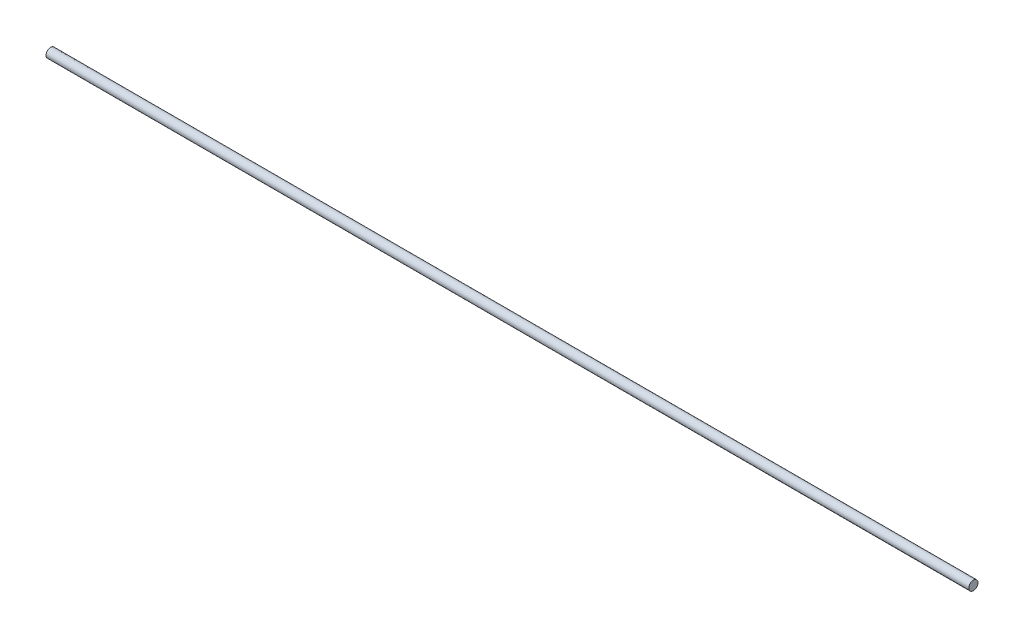
ISO-10303-21;
HEADER;
FILE_DESCRIPTION(('STEP AP214'),'2;1');
FILE_NAME('part.step','',(''),(''),'','','');
FILE_SCHEMA(('AUTOMOTIVE_DESIGN { 1 0 10303 214 1 1 1 1 }'));
ENDSEC;
DATA;
#1=APPLICATION_CONTEXT('core data for automotive mechanical design processes');
#2=APPLICATION_PROTOCOL_DEFINITION('international standard','automotive_design',2000,#1);
#3=PRODUCT_CONTEXT('',#1,'mechanical');
#4=PRODUCT('Part','Part','',(#3));
#5=PRODUCT_RELATED_PRODUCT_CATEGORY('part','',(#4));
#6=PRODUCT_DEFINITION_FORMATION('','',#4);
#7=PRODUCT_DEFINITION_CONTEXT('part definition',#1,'design');
#8=PRODUCT_DEFINITION('design','',#6,#7);
#9=PRODUCT_DEFINITION_SHAPE('','',#8);
#10=(LENGTH_UNIT() NAMED_UNIT(*) SI_UNIT(.MILLI.,.METRE.));
#11=(NAMED_UNIT(*) PLANE_ANGLE_UNIT() SI_UNIT($,.RADIAN.));
#12=(NAMED_UNIT(*) SI_UNIT($,.STERADIAN.) SOLID_ANGLE_UNIT());
#13=UNCERTAINTY_MEASURE_WITH_UNIT(LENGTH_MEASURE(1.E-05),#10,'distance_accuracy_value','');
#14=(GEOMETRIC_REPRESENTATION_CONTEXT(3) GLOBAL_UNCERTAINTY_ASSIGNED_CONTEXT((#13)) GLOBAL_UNIT_ASSIGNED_CONTEXT((#10,
#11,#12)) REPRESENTATION_CONTEXT('',''));
#15=CARTESIAN_POINT('',(0.,0.,0.));
#16=DIRECTION('',(0.,0.,1.));
#17=DIRECTION('',(1.,0.,0.));
#18=AXIS2_PLACEMENT_3D('',#15,#16,#17);
#19=CARTESIAN_POINT('',(800.,0.,0.));
#20=DIRECTION('',(-1.,0.,0.));
#21=DIRECTION('',(0.,0.,1.));
#22=AXIS2_PLACEMENT_3D('',#19,#20,#21);
#23=CYLINDRICAL_SURFACE('',#22,4.);
#24=CARTESIAN_POINT('',(800.,0.,0.));
#25=DIRECTION('',(1.,0.,0.));
#26=DIRECTION('',(0.,0.,-1.));
#27=AXIS2_PLACEMENT_3D('',#24,#25,#26);
#28=CIRCLE('',#27,4.);
#29=CARTESIAN_POINT('',(800.,0.,-4.));
#30=VERTEX_POINT('',#29);
#31=EDGE_CURVE('E10',#30,#30,#28,.T.);
#32=ORIENTED_EDGE('',*,*,#31,.F.);
#33=EDGE_LOOP('',(#32));
#34=FACE_BOUND('',#33,.T.);
#35=CARTESIAN_POINT('',(0.,0.,0.));
#36=DIRECTION('',(1.,0.,0.));
#37=DIRECTION('',(0.,0.,-1.));
#38=AXIS2_PLACEMENT_3D('',#35,#36,#37);
#39=CIRCLE('',#38,4.);
#40=CARTESIAN_POINT('',(0.,0.,-4.));
#41=VERTEX_POINT('',#40);
#42=EDGE_CURVE('E33',#41,#41,#39,.T.);
#43=ORIENTED_EDGE('',*,*,#42,.T.);
#44=EDGE_LOOP('',(#43));
#45=FACE_BOUND('',#44,.T.);
#46=ADVANCED_FACE('F30',(#34,#45),#23,.T.);
#47=CARTESIAN_POINT('',(800.,0.,0.));
#48=DIRECTION('',(1.,0.,0.));
#49=DIRECTION('',(0.,0.,-1.));
#50=AXIS2_PLACEMENT_3D('',#47,#48,#49);
#51=PLANE('',#50);
#52=ORIENTED_EDGE('',*,*,#31,.T.);
#53=EDGE_LOOP('',(#52));
#54=FACE_BOUND('',#53,.T.);
#55=ADVANCED_FACE('F45',(#54),#51,.T.);
#56=CARTESIAN_POINT('',(0.,0.,0.));
#57=DIRECTION('',(1.,0.,0.));
#58=DIRECTION('',(0.,0.,-1.));
#59=AXIS2_PLACEMENT_3D('',#56,#57,#58);
#60=PLANE('',#59);
#61=ORIENTED_EDGE('',*,*,#42,.F.);
#62=EDGE_LOOP('',(#61));
#63=FACE_BOUND('',#62,.T.);
#64=ADVANCED_FACE('F43',(#63),#60,.F.);
#65=CLOSED_SHELL('',(#46,#55,#64));
#66=MANIFOLD_SOLID_BREP('B2',#65);
#67=ADVANCED_BREP_SHAPE_REPRESENTATION('',(#18,#66),#14);
#68=SHAPE_DEFINITION_REPRESENTATION(#9,#67);
ENDSEC;
END-ISO-10303-21;
